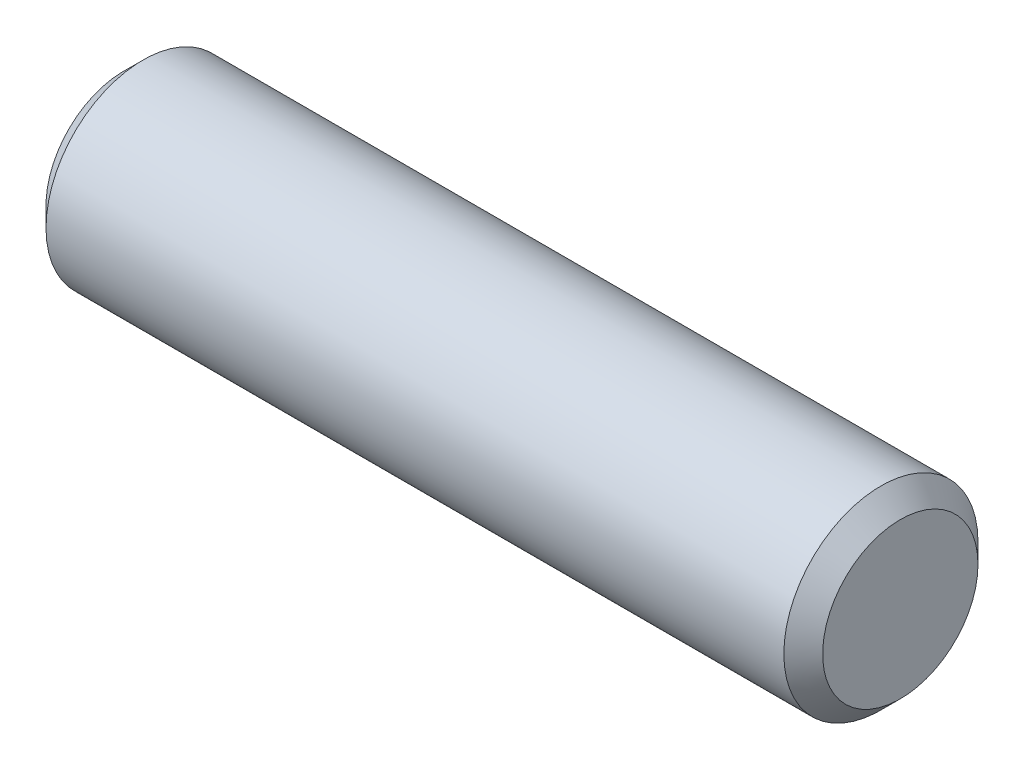
ISO-10303-21;
HEADER;
FILE_DESCRIPTION(('STEP AP214'),'2;1');
FILE_NAME('part.step','',(''),(''),'','','');
FILE_SCHEMA(('AUTOMOTIVE_DESIGN { 1 0 10303 214 1 1 1 1 }'));
ENDSEC;
DATA;
#1=APPLICATION_CONTEXT('core data for automotive mechanical design processes');
#2=APPLICATION_PROTOCOL_DEFINITION('international standard','automotive_design',2000,#1);
#3=PRODUCT_CONTEXT('',#1,'mechanical');
#4=PRODUCT('Part','Part','',(#3));
#5=PRODUCT_RELATED_PRODUCT_CATEGORY('part','',(#4));
#6=PRODUCT_DEFINITION_FORMATION('','',#4);
#7=PRODUCT_DEFINITION_CONTEXT('part definition',#1,'design');
#8=PRODUCT_DEFINITION('design','',#6,#7);
#9=PRODUCT_DEFINITION_SHAPE('','',#8);
#10=(LENGTH_UNIT() NAMED_UNIT(*) SI_UNIT(.MILLI.,.METRE.));
#11=(NAMED_UNIT(*) PLANE_ANGLE_UNIT() SI_UNIT($,.RADIAN.));
#12=(NAMED_UNIT(*) SI_UNIT($,.STERADIAN.) SOLID_ANGLE_UNIT());
#13=UNCERTAINTY_MEASURE_WITH_UNIT(LENGTH_MEASURE(1.E-05),#10,'distance_accuracy_value','');
#14=(GEOMETRIC_REPRESENTATION_CONTEXT(3) GLOBAL_UNCERTAINTY_ASSIGNED_CONTEXT((#13)) GLOBAL_UNIT_ASSIGNED_CONTEXT((#10,
#11,#12)) REPRESENTATION_CONTEXT('',''));
#15=CARTESIAN_POINT('',(0.,0.,0.));
#16=DIRECTION('',(0.,0.,1.));
#17=DIRECTION('',(1.,0.,0.));
#18=AXIS2_PLACEMENT_3D('',#15,#16,#17);
#19=CARTESIAN_POINT('',(-6.35,0.,0.));
#20=DIRECTION('',(1.,0.,0.));
#21=DIRECTION('',(0.,0.,-1.));
#22=AXIS2_PLACEMENT_3D('',#19,#20,#21);
#23=CYLINDRICAL_SURFACE('',#22,1.5875);
#24=CARTESIAN_POINT('',(6.0325,0.,0.));
#25=DIRECTION('',(1.,0.,0.));
#26=DIRECTION('',(0.,0.,-1.));
#27=AXIS2_PLACEMENT_3D('',#24,#25,#26);
#28=CIRCLE('',#27,1.5875);
#29=CARTESIAN_POINT('',(6.0325,0.,-1.5875));
#30=VERTEX_POINT('',#29);
#31=EDGE_CURVE('E43',#30,#30,#28,.F.);
#32=ORIENTED_EDGE('',*,*,#31,.T.);
#33=EDGE_LOOP('',(#32));
#34=FACE_BOUND('',#33,.T.);
#35=CARTESIAN_POINT('',(-6.0325,0.,0.));
#36=DIRECTION('',(1.,0.,0.));
#37=DIRECTION('',(0.,0.,-1.));
#38=AXIS2_PLACEMENT_3D('',#35,#36,#37);
#39=CIRCLE('',#38,1.5875);
#40=CARTESIAN_POINT('',(-6.0325,0.,-1.5875));
#41=VERTEX_POINT('',#40);
#42=EDGE_CURVE('E48',#41,#41,#39,.T.);
#43=ORIENTED_EDGE('',*,*,#42,.T.);
#44=EDGE_LOOP('',(#43));
#45=FACE_BOUND('',#44,.T.);
#46=ADVANCED_FACE('F35',(#34,#45),#23,.T.);
#47=CARTESIAN_POINT('',(-6.35,0.,0.));
#48=DIRECTION('',(1.,0.,0.));
#49=DIRECTION('',(0.,0.,-1.));
#50=AXIS2_PLACEMENT_3D('',#47,#48,#49);
#51=PLANE('',#50);
#52=CARTESIAN_POINT('',(-6.35,0.,0.));
#53=DIRECTION('',(1.,0.,0.));
#54=DIRECTION('',(0.,0.,-1.));
#55=AXIS2_PLACEMENT_3D('',#52,#53,#54);
#56=CIRCLE('',#55,1.27);
#57=CARTESIAN_POINT('',(-6.35,0.,-1.27));
#58=VERTEX_POINT('',#57);
#59=EDGE_CURVE('E10',#58,#58,#56,.F.);
#60=ORIENTED_EDGE('',*,*,#59,.T.);
#61=EDGE_LOOP('',(#60));
#62=FACE_BOUND('',#61,.T.);
#63=ADVANCED_FACE('F68',(#62),#51,.F.);
#64=CARTESIAN_POINT('',(6.35,0.,0.));
#65=DIRECTION('',(1.,0.,0.));
#66=DIRECTION('',(0.,0.,-1.));
#67=AXIS2_PLACEMENT_3D('',#64,#65,#66);
#68=PLANE('',#67);
#69=CARTESIAN_POINT('',(6.35,0.,0.));
#70=DIRECTION('',(1.,0.,0.));
#71=DIRECTION('',(0.,0.,-1.));
#72=AXIS2_PLACEMENT_3D('',#69,#70,#71);
#73=CIRCLE('',#72,1.27);
#74=CARTESIAN_POINT('',(6.35,0.,-1.27));
#75=VERTEX_POINT('',#74);
#76=EDGE_CURVE('E52',#75,#75,#73,.T.);
#77=ORIENTED_EDGE('',*,*,#76,.T.);
#78=EDGE_LOOP('',(#77));
#79=FACE_BOUND('',#78,.T.);
#80=ADVANCED_FACE('F58',(#79),#68,.T.);
#81=CARTESIAN_POINT('',(6.35,0.,0.));
#82=DIRECTION('',(-1.,0.,0.));
#83=DIRECTION('',(0.,0.,1.));
#84=AXIS2_PLACEMENT_3D('',#81,#82,#83);
#85=CONICAL_SURFACE('',#84,1.27,0.785398163397445);
#86=ORIENTED_EDGE('',*,*,#31,.F.);
#87=EDGE_LOOP('',(#86));
#88=FACE_BOUND('',#87,.T.);
#89=ORIENTED_EDGE('',*,*,#76,.F.);
#90=EDGE_LOOP('',(#89));
#91=FACE_BOUND('',#90,.T.);
#92=ADVANCED_FACE('F60',(#88,#91),#85,.T.);
#93=CARTESIAN_POINT('',(-6.0325,0.,0.));
#94=DIRECTION('',(1.,0.,0.));
#95=DIRECTION('',(0.,0.,-1.));
#96=AXIS2_PLACEMENT_3D('',#93,#94,#95);
#97=CONICAL_SURFACE('',#96,1.5875,0.785398163397448);
#98=ORIENTED_EDGE('',*,*,#59,.F.);
#99=EDGE_LOOP('',(#98));
#100=FACE_BOUND('',#99,.T.);
#101=ORIENTED_EDGE('',*,*,#42,.F.);
#102=EDGE_LOOP('',(#101));
#103=FACE_BOUND('',#102,.T.);
#104=ADVANCED_FACE('F37',(#100,#103),#97,.T.);
#105=CLOSED_SHELL('',(#46,#63,#80,#92,#104));
#106=MANIFOLD_SOLID_BREP('B2',#105);
#107=ADVANCED_BREP_SHAPE_REPRESENTATION('',(#18,#106),#14);
#108=SHAPE_DEFINITION_REPRESENTATION(#9,#107);
ENDSEC;
END-ISO-10303-21;
